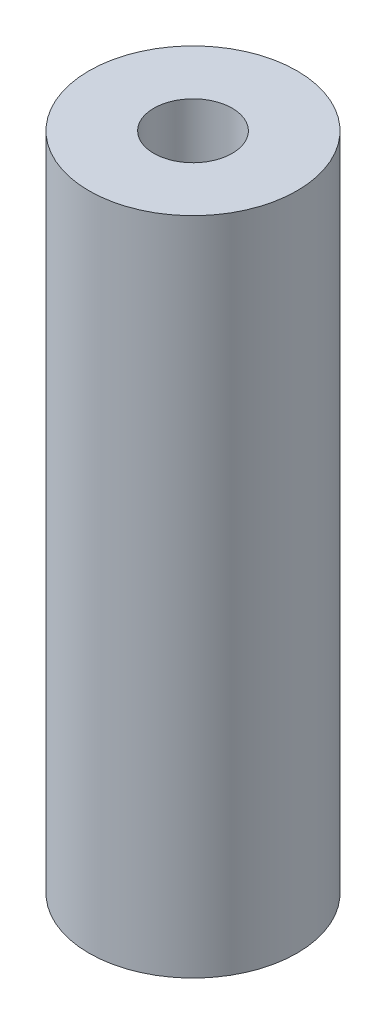
ISO-10303-21;
HEADER;
FILE_DESCRIPTION(('STEP AP214'),'2;1');
FILE_NAME('part.step','',(''),(''),'','','');
FILE_SCHEMA(('AUTOMOTIVE_DESIGN { 1 0 10303 214 1 1 1 1 }'));
ENDSEC;
DATA;
#1=APPLICATION_CONTEXT('core data for automotive mechanical design processes');
#2=APPLICATION_PROTOCOL_DEFINITION('international standard','automotive_design',2000,#1);
#3=PRODUCT_CONTEXT('',#1,'mechanical');
#4=PRODUCT('Part','Part','',(#3));
#5=PRODUCT_RELATED_PRODUCT_CATEGORY('part','',(#4));
#6=PRODUCT_DEFINITION_FORMATION('','',#4);
#7=PRODUCT_DEFINITION_CONTEXT('part definition',#1,'design');
#8=PRODUCT_DEFINITION('design','',#6,#7);
#9=PRODUCT_DEFINITION_SHAPE('','',#8);
#10=(LENGTH_UNIT() NAMED_UNIT(*) SI_UNIT(.MILLI.,.METRE.));
#11=(NAMED_UNIT(*) PLANE_ANGLE_UNIT() SI_UNIT($,.RADIAN.));
#12=(NAMED_UNIT(*) SI_UNIT($,.STERADIAN.) SOLID_ANGLE_UNIT());
#13=UNCERTAINTY_MEASURE_WITH_UNIT(LENGTH_MEASURE(1.E-05),#10,'distance_accuracy_value','');
#14=(GEOMETRIC_REPRESENTATION_CONTEXT(3) GLOBAL_UNCERTAINTY_ASSIGNED_CONTEXT((#13)) GLOBAL_UNIT_ASSIGNED_CONTEXT((#10,
#11,#12)) REPRESENTATION_CONTEXT('',''));
#15=CARTESIAN_POINT('',(0.,0.,0.));
#16=DIRECTION('',(0.,0.,1.));
#17=DIRECTION('',(1.,0.,0.));
#18=AXIS2_PLACEMENT_3D('',#15,#16,#17);
#19=CARTESIAN_POINT('',(0.,19.05,0.));
#20=DIRECTION('',(0.,-1.,0.));
#21=DIRECTION('',(0.,0.,-1.));
#22=AXIS2_PLACEMENT_3D('',#19,#20,#21);
#23=CYLINDRICAL_SURFACE('',#22,3.);
#24=CARTESIAN_POINT('',(0.,19.05,0.));
#25=DIRECTION('',(0.,1.,0.));
#26=DIRECTION('',(0.,0.,1.));
#27=AXIS2_PLACEMENT_3D('',#24,#25,#26);
#28=CIRCLE('',#27,3.);
#29=CARTESIAN_POINT('',(0.,19.05,3.));
#30=VERTEX_POINT('',#29);
#31=EDGE_CURVE('E10',#30,#30,#28,.T.);
#32=ORIENTED_EDGE('',*,*,#31,.F.);
#33=EDGE_LOOP('',(#32));
#34=FACE_BOUND('',#33,.T.);
#35=CARTESIAN_POINT('',(0.,0.,0.));
#36=DIRECTION('',(0.,1.,0.));
#37=DIRECTION('',(0.,0.,1.));
#38=AXIS2_PLACEMENT_3D('',#35,#36,#37);
#39=CIRCLE('',#38,3.);
#40=CARTESIAN_POINT('',(0.,0.,3.));
#41=VERTEX_POINT('',#40);
#42=EDGE_CURVE('E35',#41,#41,#39,.T.);
#43=ORIENTED_EDGE('',*,*,#42,.T.);
#44=EDGE_LOOP('',(#43));
#45=FACE_BOUND('',#44,.T.);
#46=ADVANCED_FACE('F32',(#34,#45),#23,.T.);
#47=CARTESIAN_POINT('',(0.,19.05,0.));
#48=DIRECTION('',(0.,1.,0.));
#49=DIRECTION('',(0.,0.,1.));
#50=AXIS2_PLACEMENT_3D('',#47,#48,#49);
#51=PLANE('',#50);
#52=CARTESIAN_POINT('',(0.,19.05,0.));
#53=DIRECTION('',(0.,-1.,0.));
#54=DIRECTION('',(0.,0.,-1.));
#55=AXIS2_PLACEMENT_3D('',#52,#53,#54);
#56=CIRCLE('',#55,1.1303);
#57=CARTESIAN_POINT('',(0.,19.05,-1.1303));
#58=VERTEX_POINT('',#57);
#59=EDGE_CURVE('E42',#58,#58,#56,.T.);
#60=ORIENTED_EDGE('',*,*,#59,.T.);
#61=EDGE_LOOP('',(#60));
#62=FACE_BOUND('',#61,.T.);
#63=ORIENTED_EDGE('',*,*,#31,.T.);
#64=EDGE_LOOP('',(#63));
#65=FACE_BOUND('',#64,.T.);
#66=ADVANCED_FACE('F55',(#62,#65),#51,.T.);
#67=CARTESIAN_POINT('',(0.,0.,0.));
#68=DIRECTION('',(0.,1.,0.));
#69=DIRECTION('',(0.,0.,1.));
#70=AXIS2_PLACEMENT_3D('',#67,#68,#69);
#71=PLANE('',#70);
#72=CARTESIAN_POINT('',(0.,0.,0.));
#73=DIRECTION('',(0.,-1.,0.));
#74=DIRECTION('',(0.,0.,-1.));
#75=AXIS2_PLACEMENT_3D('',#72,#73,#74);
#76=CIRCLE('',#75,1.1303);
#77=CARTESIAN_POINT('',(0.,0.,-1.1303));
#78=VERTEX_POINT('',#77);
#79=EDGE_CURVE('E46',#78,#78,#76,.T.);
#80=ORIENTED_EDGE('',*,*,#79,.F.);
#81=EDGE_LOOP('',(#80));
#82=FACE_BOUND('',#81,.T.);
#83=ORIENTED_EDGE('',*,*,#42,.F.);
#84=EDGE_LOOP('',(#83));
#85=FACE_BOUND('',#84,.T.);
#86=ADVANCED_FACE('F52',(#82,#85),#71,.F.);
#87=CARTESIAN_POINT('',(0.,0.,0.));
#88=DIRECTION('',(0.,-1.,0.));
#89=DIRECTION('',(0.,0.,-1.));
#90=AXIS2_PLACEMENT_3D('',#87,#88,#89);
#91=CYLINDRICAL_SURFACE('',#90,1.1303);
#92=ORIENTED_EDGE('',*,*,#59,.F.);
#93=EDGE_LOOP('',(#92));
#94=FACE_BOUND('',#93,.T.);
#95=ORIENTED_EDGE('',*,*,#79,.T.);
#96=EDGE_LOOP('',(#95));
#97=FACE_BOUND('',#96,.T.);
#98=ADVANCED_FACE('F50',(#94,#97),#91,.F.);
#99=CLOSED_SHELL('',(#46,#66,#86,#98));
#100=MANIFOLD_SOLID_BREP('B2',#99);
#101=ADVANCED_BREP_SHAPE_REPRESENTATION('',(#18,#100),#14);
#102=SHAPE_DEFINITION_REPRESENTATION(#9,#101);
ENDSEC;
END-ISO-10303-21;
